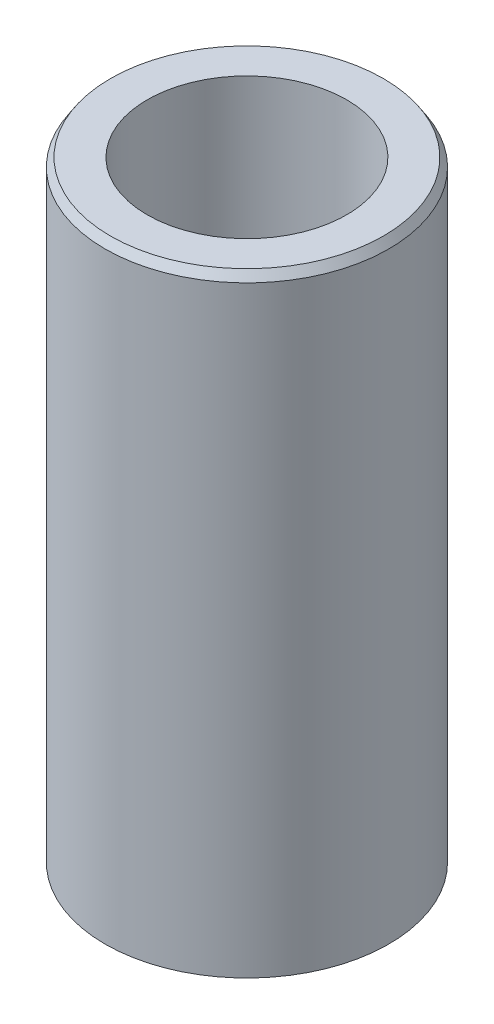
ISO-10303-21;
HEADER;
FILE_DESCRIPTION(('STEP AP214'),'2;1');
FILE_NAME('part.step','',(''),(''),'','','');
FILE_SCHEMA(('AUTOMOTIVE_DESIGN { 1 0 10303 214 1 1 1 1 }'));
ENDSEC;
DATA;
#1=APPLICATION_CONTEXT('core data for automotive mechanical design processes');
#2=APPLICATION_PROTOCOL_DEFINITION('international standard','automotive_design',2000,#1);
#3=PRODUCT_CONTEXT('',#1,'mechanical');
#4=PRODUCT('Part','Part','',(#3));
#5=PRODUCT_RELATED_PRODUCT_CATEGORY('part','',(#4));
#6=PRODUCT_DEFINITION_FORMATION('','',#4);
#7=PRODUCT_DEFINITION_CONTEXT('part definition',#1,'design');
#8=PRODUCT_DEFINITION('design','',#6,#7);
#9=PRODUCT_DEFINITION_SHAPE('','',#8);
#10=(LENGTH_UNIT() NAMED_UNIT(*) SI_UNIT(.MILLI.,.METRE.));
#11=(NAMED_UNIT(*) PLANE_ANGLE_UNIT() SI_UNIT($,.RADIAN.));
#12=(NAMED_UNIT(*) SI_UNIT($,.STERADIAN.) SOLID_ANGLE_UNIT());
#13=UNCERTAINTY_MEASURE_WITH_UNIT(LENGTH_MEASURE(1.E-05),#10,'distance_accuracy_value','');
#14=(GEOMETRIC_REPRESENTATION_CONTEXT(3) GLOBAL_UNCERTAINTY_ASSIGNED_CONTEXT((#13)) GLOBAL_UNIT_ASSIGNED_CONTEXT((#10,
#11,#12)) REPRESENTATION_CONTEXT('',''));
#15=CARTESIAN_POINT('',(0.,0.,0.));
#16=DIRECTION('',(0.,0.,1.));
#17=DIRECTION('',(1.,0.,0.));
#18=AXIS2_PLACEMENT_3D('',#15,#16,#17);
#19=CARTESIAN_POINT('',(0.,173.665812917948,0.));
#20=DIRECTION('',(0.,-1.,0.));
#21=DIRECTION('',(0.,0.,-1.));
#22=AXIS2_PLACEMENT_3D('',#19,#20,#21);
#23=CYLINDRICAL_SURFACE('',#22,40.);
#24=CARTESIAN_POINT('',(0.,171.274753086586,0.));
#25=DIRECTION('',(0.,1.,0.));
#26=DIRECTION('',(0.,0.,1.));
#27=AXIS2_PLACEMENT_3D('',#24,#25,#26);
#28=CIRCLE('',#27,40.);
#29=CARTESIAN_POINT('',(0.,171.274753086586,40.));
#30=VERTEX_POINT('',#29);
#31=EDGE_CURVE('E50',#30,#30,#28,.F.);
#32=ORIENTED_EDGE('',*,*,#31,.T.);
#33=EDGE_LOOP('',(#32));
#34=FACE_BOUND('',#33,.T.);
#35=CARTESIAN_POINT('',(0.,1.52531629343133,0.));
#36=DIRECTION('',(0.,1.,0.));
#37=DIRECTION('',(0.,0.,1.));
#38=AXIS2_PLACEMENT_3D('',#35,#36,#37);
#39=CIRCLE('',#38,40.);
#40=CARTESIAN_POINT('',(0.,1.52531629343133,40.));
#41=VERTEX_POINT('',#40);
#42=EDGE_CURVE('E51',#41,#41,#39,.T.);
#43=ORIENTED_EDGE('',*,*,#42,.T.);
#44=EDGE_LOOP('',(#43));
#45=FACE_BOUND('',#44,.T.);
#46=ADVANCED_FACE('F39',(#34,#45),#23,.T.);
#47=CARTESIAN_POINT('',(0.,173.665812917948,0.));
#48=DIRECTION('',(0.,1.,0.));
#49=DIRECTION('',(0.,0.,1.));
#50=AXIS2_PLACEMENT_3D('',#47,#48,#49);
#51=PLANE('',#50);
#52=CARTESIAN_POINT('',(0.,173.665812917948,0.));
#53=DIRECTION('',(0.,1.,0.));
#54=DIRECTION('',(0.,0.,1.));
#55=AXIS2_PLACEMENT_3D('',#52,#53,#54);
#56=CIRCLE('',#55,38.4746837065687);
#57=CARTESIAN_POINT('',(0.,173.665812917948,38.4746837065687));
#58=VERTEX_POINT('',#57);
#59=EDGE_CURVE('E54',#58,#58,#56,.T.);
#60=ORIENTED_EDGE('',*,*,#59,.T.);
#61=EDGE_LOOP('',(#60));
#62=FACE_BOUND('',#61,.T.);
#63=CARTESIAN_POINT('',(0.,173.665812917948,0.));
#64=DIRECTION('',(0.,1.,0.));
#65=DIRECTION('',(0.,0.,1.));
#66=AXIS2_PLACEMENT_3D('',#63,#64,#65);
#67=CIRCLE('',#66,28.116705363986);
#68=CARTESIAN_POINT('',(0.,173.665812917948,28.116705363986));
#69=VERTEX_POINT('',#68);
#70=EDGE_CURVE('E58',#69,#69,#67,.T.);
#71=ORIENTED_EDGE('',*,*,#70,.F.);
#72=EDGE_LOOP('',(#71));
#73=FACE_BOUND('',#72,.T.);
#74=ADVANCED_FACE('F69',(#62,#73),#51,.T.);
#75=CARTESIAN_POINT('',(0.,0.,0.));
#76=DIRECTION('',(0.,1.,0.));
#77=DIRECTION('',(0.,0.,1.));
#78=AXIS2_PLACEMENT_3D('',#75,#76,#77);
#79=PLANE('',#78);
#80=CARTESIAN_POINT('',(0.,0.,0.));
#81=DIRECTION('',(0.,1.,0.));
#82=DIRECTION('',(0.,0.,1.));
#83=AXIS2_PLACEMENT_3D('',#80,#81,#82);
#84=CIRCLE('',#83,37.6089401686387);
#85=CARTESIAN_POINT('',(0.,0.,37.6089401686387));
#86=VERTEX_POINT('',#85);
#87=EDGE_CURVE('E10',#86,#86,#84,.F.);
#88=ORIENTED_EDGE('',*,*,#87,.T.);
#89=EDGE_LOOP('',(#88));
#90=FACE_BOUND('',#89,.T.);
#91=CARTESIAN_POINT('',(0.,0.,0.));
#92=DIRECTION('',(0.,1.,0.));
#93=DIRECTION('',(0.,0.,1.));
#94=AXIS2_PLACEMENT_3D('',#91,#92,#93);
#95=CIRCLE('',#94,28.116705363986);
#96=CARTESIAN_POINT('',(0.,0.,28.116705363986));
#97=VERTEX_POINT('',#96);
#98=EDGE_CURVE('E63',#97,#97,#95,.T.);
#99=ORIENTED_EDGE('',*,*,#98,.T.);
#100=EDGE_LOOP('',(#99));
#101=FACE_BOUND('',#100,.T.);
#102=ADVANCED_FACE('F75',(#90,#101),#79,.F.);
#103=CARTESIAN_POINT('',(0.,173.665812917948,0.));
#104=DIRECTION('',(0.,-1.,0.));
#105=DIRECTION('',(0.,0.,-1.));
#106=AXIS2_PLACEMENT_3D('',#103,#104,#105);
#107=CYLINDRICAL_SURFACE('',#106,28.116705363986);
#108=ORIENTED_EDGE('',*,*,#70,.T.);
#109=EDGE_LOOP('',(#108));
#110=FACE_BOUND('',#109,.T.);
#111=ORIENTED_EDGE('',*,*,#98,.F.);
#112=EDGE_LOOP('',(#111));
#113=FACE_BOUND('',#112,.T.);
#114=ADVANCED_FACE('F70',(#110,#113),#107,.F.);
#115=CARTESIAN_POINT('',(0.,173.665812917948,0.));
#116=DIRECTION('',(0.,-1.,0.));
#117=DIRECTION('',(0.,0.,-1.));
#118=AXIS2_PLACEMENT_3D('',#115,#116,#117);
#119=CONICAL_SURFACE('',#118,38.4746837065687,0.567839591877817);
#120=ORIENTED_EDGE('',*,*,#31,.F.);
#121=EDGE_LOOP('',(#120));
#122=FACE_BOUND('',#121,.T.);
#123=ORIENTED_EDGE('',*,*,#59,.F.);
#124=EDGE_LOOP('',(#123));
#125=FACE_BOUND('',#124,.T.);
#126=ADVANCED_FACE('F81',(#122,#125),#119,.T.);
#127=CARTESIAN_POINT('',(0.,1.52531629343133,0.));
#128=DIRECTION('',(0.,1.,0.));
#129=DIRECTION('',(0.,0.,1.));
#130=AXIS2_PLACEMENT_3D('',#127,#128,#129);
#131=CONICAL_SURFACE('',#130,40.,1.00295673491709);
#132=ORIENTED_EDGE('',*,*,#87,.F.);
#133=EDGE_LOOP('',(#132));
#134=FACE_BOUND('',#133,.T.);
#135=ORIENTED_EDGE('',*,*,#42,.F.);
#136=EDGE_LOOP('',(#135));
#137=FACE_BOUND('',#136,.T.);
#138=ADVANCED_FACE('F45',(#134,#137),#131,.T.);
#139=CLOSED_SHELL('',(#46,#74,#102,#114,#126,#138));
#140=MANIFOLD_SOLID_BREP('B2',#139);
#141=ADVANCED_BREP_SHAPE_REPRESENTATION('',(#18,#140),#14);
#142=SHAPE_DEFINITION_REPRESENTATION(#9,#141);
ENDSEC;
END-ISO-10303-21;
